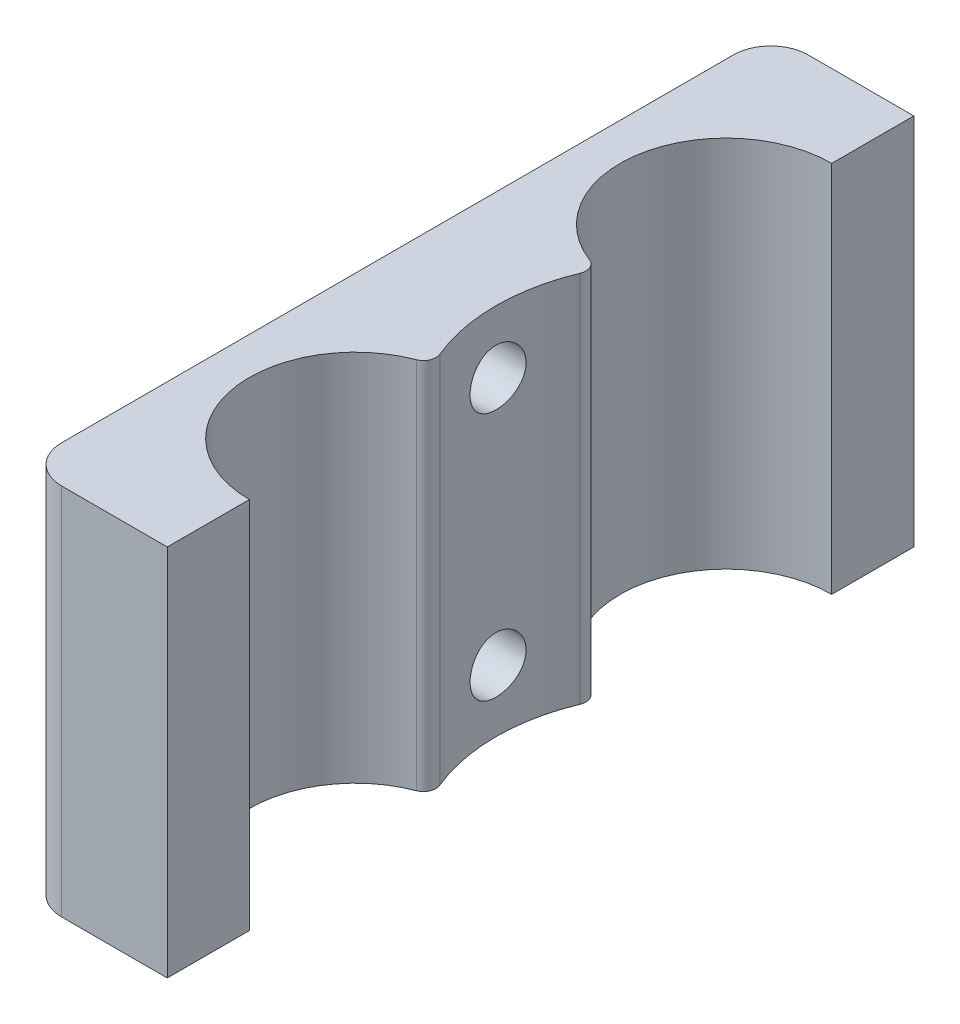
ISO-10303-21;
HEADER;
FILE_DESCRIPTION(('STEP AP214'),'2;1');
FILE_NAME('part.step','',(''),(''),'','','');
FILE_SCHEMA(('AUTOMOTIVE_DESIGN { 1 0 10303 214 1 1 1 1 }'));
ENDSEC;
DATA;
#1=APPLICATION_CONTEXT('core data for automotive mechanical design processes');
#2=APPLICATION_PROTOCOL_DEFINITION('international standard','automotive_design',2000,#1);
#3=PRODUCT_CONTEXT('',#1,'mechanical');
#4=PRODUCT('Part','Part','',(#3));
#5=PRODUCT_RELATED_PRODUCT_CATEGORY('part','',(#4));
#6=PRODUCT_DEFINITION_FORMATION('','',#4);
#7=PRODUCT_DEFINITION_CONTEXT('part definition',#1,'design');
#8=PRODUCT_DEFINITION('design','',#6,#7);
#9=PRODUCT_DEFINITION_SHAPE('','',#8);
#10=(LENGTH_UNIT() NAMED_UNIT(*) SI_UNIT(.MILLI.,.METRE.));
#11=(NAMED_UNIT(*) PLANE_ANGLE_UNIT() SI_UNIT($,.RADIAN.));
#12=(NAMED_UNIT(*) SI_UNIT($,.STERADIAN.) SOLID_ANGLE_UNIT());
#13=UNCERTAINTY_MEASURE_WITH_UNIT(LENGTH_MEASURE(1.E-05),#10,'distance_accuracy_value','');
#14=(GEOMETRIC_REPRESENTATION_CONTEXT(3) GLOBAL_UNCERTAINTY_ASSIGNED_CONTEXT((#13)) GLOBAL_UNIT_ASSIGNED_CONTEXT((#10,
#11,#12)) REPRESENTATION_CONTEXT('',''));
#15=CARTESIAN_POINT('',(0.,0.,0.));
#16=DIRECTION('',(0.,0.,1.));
#17=DIRECTION('',(1.,0.,0.));
#18=AXIS2_PLACEMENT_3D('',#15,#16,#17);
#19=CARTESIAN_POINT('',(-11.5,30.,0.));
#20=DIRECTION('',(0.,0.,1.));
#21=DIRECTION('',(1.,0.,0.));
#22=AXIS2_PLACEMENT_3D('',#19,#20,#21);
#23=PLANE('',#22);
#24=DIRECTION('',(-1.,0.,0.));
#25=VECTOR('',#24,1.);
#26=CARTESIAN_POINT('',(-11.5,30.,0.));
#27=LINE('',#26,#25);
#28=CARTESIAN_POINT('',(0.,30.,0.));
#29=VERTEX_POINT('',#28);
#30=CARTESIAN_POINT('',(-8.49999999999999,30.,0.));
#31=VERTEX_POINT('',#30);
#32=EDGE_CURVE('E166',#29,#31,#27,.T.);
#33=ORIENTED_EDGE('',*,*,#32,.T.);
#34=DIRECTION('',(0.,-1.,0.));
#35=VECTOR('',#34,1.);
#36=CARTESIAN_POINT('',(-8.49999999999999,30.,0.));
#37=LINE('',#36,#35);
#38=CARTESIAN_POINT('',(-8.49999999999999,0.,0.));
#39=VERTEX_POINT('',#38);
#40=EDGE_CURVE('E191',#31,#39,#37,.T.);
#41=ORIENTED_EDGE('',*,*,#40,.T.);
#42=DIRECTION('',(-1.,0.,0.));
#43=VECTOR('',#42,1.);
#44=CARTESIAN_POINT('',(-11.5,0.,0.));
#45=LINE('',#44,#43);
#46=CARTESIAN_POINT('',(0.,0.,0.));
#47=VERTEX_POINT('',#46);
#48=EDGE_CURVE('E148',#47,#39,#45,.T.);
#49=ORIENTED_EDGE('',*,*,#48,.F.);
#50=DIRECTION('',(0.,-1.,0.));
#51=VECTOR('',#50,1.);
#52=CARTESIAN_POINT('',(0.,30.,0.));
#53=LINE('',#52,#51);
#54=EDGE_CURVE('E167',#29,#47,#53,.T.);
#55=ORIENTED_EDGE('',*,*,#54,.F.);
#56=EDGE_LOOP('',(#33,#41,#49,#55));
#57=FACE_BOUND('',#56,.T.);
#58=ADVANCED_FACE('F32',(#57),#23,.T.);
#59=CARTESIAN_POINT('',(0.,30.,-6.6));
#60=DIRECTION('',(1.,0.,0.));
#61=DIRECTION('',(0.,0.,-1.));
#62=AXIS2_PLACEMENT_3D('',#59,#60,#61);
#63=PLANE('',#62);
#64=DIRECTION('',(0.,0.,1.));
#65=VECTOR('',#64,1.);
#66=CARTESIAN_POINT('',(0.,0.,-6.6));
#67=LINE('',#66,#65);
#68=CARTESIAN_POINT('',(0.,0.,-6.6));
#69=VERTEX_POINT('',#68);
#70=EDGE_CURVE('E163',#69,#47,#67,.T.);
#71=ORIENTED_EDGE('',*,*,#70,.F.);
#72=DIRECTION('',(0.,-1.,0.));
#73=VECTOR('',#72,1.);
#74=CARTESIAN_POINT('',(0.,30.,-6.6));
#75=LINE('',#74,#73);
#76=CARTESIAN_POINT('',(0.,30.,-6.6));
#77=VERTEX_POINT('',#76);
#78=EDGE_CURVE('E170',#77,#69,#75,.T.);
#79=ORIENTED_EDGE('',*,*,#78,.F.);
#80=DIRECTION('',(0.,0.,1.));
#81=VECTOR('',#80,1.);
#82=CARTESIAN_POINT('',(0.,30.,-6.6));
#83=LINE('',#82,#81);
#84=EDGE_CURVE('E134',#77,#29,#83,.T.);
#85=ORIENTED_EDGE('',*,*,#84,.T.);
#86=ORIENTED_EDGE('',*,*,#54,.T.);
#87=EDGE_LOOP('',(#71,#79,#85,#86));
#88=FACE_BOUND('',#87,.T.);
#89=ADVANCED_FACE('F242',(#88),#63,.T.);
#90=CARTESIAN_POINT('',(0.,30.,-15.1));
#91=DIRECTION('',(0.,-1.,0.));
#92=DIRECTION('',(0.,0.,-1.));
#93=AXIS2_PLACEMENT_3D('',#90,#91,#92);
#94=CYLINDRICAL_SURFACE('',#93,8.49999999999999);
#95=CARTESIAN_POINT('',(0.,0.,-15.1));
#96=DIRECTION('',(0.,1.,0.));
#97=DIRECTION('',(0.,0.,1.));
#98=AXIS2_PLACEMENT_3D('',#95,#96,#97);
#99=CIRCLE('',#98,8.49999999999999);
#100=CARTESIAN_POINT('',(-3.02764488857947,0.,-23.0425037883943));
#101=VERTEX_POINT('',#100);
#102=EDGE_CURVE('E161',#101,#69,#99,.T.);
#103=ORIENTED_EDGE('',*,*,#102,.F.);
#104=DIRECTION('',(0.,-1.,0.));
#105=VECTOR('',#104,1.);
#106=CARTESIAN_POINT('',(-3.02764488857947,30.,-23.0425037883943));
#107=LINE('',#106,#105);
#108=CARTESIAN_POINT('',(-3.02764488857947,30.,-23.0425037883943));
#109=VERTEX_POINT('',#108);
#110=EDGE_CURVE('E189',#101,#109,#107,.F.);
#111=ORIENTED_EDGE('',*,*,#110,.T.);
#112=CARTESIAN_POINT('',(0.,30.,-15.1));
#113=DIRECTION('',(0.,1.,0.));
#114=DIRECTION('',(0.,0.,1.));
#115=AXIS2_PLACEMENT_3D('',#112,#113,#114);
#116=CIRCLE('',#115,8.49999999999999);
#117=EDGE_CURVE('E141',#109,#77,#116,.T.);
#118=ORIENTED_EDGE('',*,*,#117,.T.);
#119=ORIENTED_EDGE('',*,*,#78,.T.);
#120=EDGE_LOOP('',(#103,#111,#118,#119));
#121=FACE_BOUND('',#120,.T.);
#122=ADVANCED_FACE('F248',(#121),#94,.F.);
#123=CARTESIAN_POINT('',(0.,30.,-44.9));
#124=DIRECTION('',(0.,-1.,0.));
#125=DIRECTION('',(0.,0.,-1.));
#126=AXIS2_PLACEMENT_3D('',#123,#124,#125);
#127=CYLINDRICAL_SURFACE('',#126,8.5);
#128=CARTESIAN_POINT('',(0.,30.,-44.9));
#129=DIRECTION('',(0.,1.,0.));
#130=DIRECTION('',(0.,0.,1.));
#131=AXIS2_PLACEMENT_3D('',#128,#129,#130);
#132=CIRCLE('',#131,8.5);
#133=CARTESIAN_POINT('',(0.,30.,-53.4));
#134=VERTEX_POINT('',#133);
#135=CARTESIAN_POINT('',(-3.02764488857949,30.,-36.9574962116057));
#136=VERTEX_POINT('',#135);
#137=EDGE_CURVE('E139',#134,#136,#132,.T.);
#138=ORIENTED_EDGE('',*,*,#137,.T.);
#139=DIRECTION('',(0.,-1.,0.));
#140=VECTOR('',#139,1.);
#141=CARTESIAN_POINT('',(-3.02764488857949,30.,-36.9574962116057));
#142=LINE('',#141,#140);
#143=CARTESIAN_POINT('',(-3.02764488857949,0.,-36.9574962116057));
#144=VERTEX_POINT('',#143);
#145=EDGE_CURVE('E169',#136,#144,#142,.T.);
#146=ORIENTED_EDGE('',*,*,#145,.T.);
#147=CARTESIAN_POINT('',(0.,0.,-44.9));
#148=DIRECTION('',(0.,1.,0.));
#149=DIRECTION('',(0.,0.,1.));
#150=AXIS2_PLACEMENT_3D('',#147,#148,#149);
#151=CIRCLE('',#150,8.5);
#152=CARTESIAN_POINT('',(0.,0.,-53.4));
#153=VERTEX_POINT('',#152);
#154=EDGE_CURVE('E158',#153,#144,#151,.T.);
#155=ORIENTED_EDGE('',*,*,#154,.F.);
#156=DIRECTION('',(0.,-1.,0.));
#157=VECTOR('',#156,1.);
#158=CARTESIAN_POINT('',(0.,30.,-53.4));
#159=LINE('',#158,#157);
#160=EDGE_CURVE('E133',#134,#153,#159,.T.);
#161=ORIENTED_EDGE('',*,*,#160,.F.);
#162=EDGE_LOOP('',(#138,#146,#155,#161));
#163=FACE_BOUND('',#162,.T.);
#164=ADVANCED_FACE('F308',(#163),#127,.F.);
#165=CARTESIAN_POINT('',(0.,30.,-60.));
#166=DIRECTION('',(1.,0.,0.));
#167=DIRECTION('',(0.,0.,-1.));
#168=AXIS2_PLACEMENT_3D('',#165,#166,#167);
#169=PLANE('',#168);
#170=DIRECTION('',(0.,0.,1.));
#171=VECTOR('',#170,1.);
#172=CARTESIAN_POINT('',(0.,0.,-60.));
#173=LINE('',#172,#171);
#174=CARTESIAN_POINT('',(0.,0.,-60.));
#175=VERTEX_POINT('',#174);
#176=EDGE_CURVE('E132',#175,#153,#173,.T.);
#177=ORIENTED_EDGE('',*,*,#176,.F.);
#178=DIRECTION('',(0.,-1.,0.));
#179=VECTOR('',#178,1.);
#180=CARTESIAN_POINT('',(0.,30.,-60.));
#181=LINE('',#180,#179);
#182=CARTESIAN_POINT('',(0.,30.,-60.));
#183=VERTEX_POINT('',#182);
#184=EDGE_CURVE('E122',#183,#175,#181,.T.);
#185=ORIENTED_EDGE('',*,*,#184,.F.);
#186=DIRECTION('',(0.,0.,1.));
#187=VECTOR('',#186,1.);
#188=CARTESIAN_POINT('',(0.,30.,-60.));
#189=LINE('',#188,#187);
#190=EDGE_CURVE('E125',#183,#134,#189,.T.);
#191=ORIENTED_EDGE('',*,*,#190,.T.);
#192=ORIENTED_EDGE('',*,*,#160,.T.);
#193=EDGE_LOOP('',(#177,#185,#191,#192));
#194=FACE_BOUND('',#193,.T.);
#195=ADVANCED_FACE('F130',(#194),#169,.T.);
#196=CARTESIAN_POINT('',(-11.5,30.,-60.));
#197=DIRECTION('',(0.,0.,-1.));
#198=DIRECTION('',(-1.,0.,0.));
#199=AXIS2_PLACEMENT_3D('',#196,#197,#198);
#200=PLANE('',#199);
#201=DIRECTION('',(1.,0.,0.));
#202=VECTOR('',#201,1.);
#203=CARTESIAN_POINT('',(-11.5,0.,-60.));
#204=LINE('',#203,#202);
#205=CARTESIAN_POINT('',(-8.49999999999999,0.,-60.));
#206=VERTEX_POINT('',#205);
#207=EDGE_CURVE('E155',#206,#175,#204,.T.);
#208=ORIENTED_EDGE('',*,*,#207,.F.);
#209=DIRECTION('',(0.,-1.,0.));
#210=VECTOR('',#209,1.);
#211=CARTESIAN_POINT('',(-8.49999999999999,30.,-60.));
#212=LINE('',#211,#210);
#213=CARTESIAN_POINT('',(-8.49999999999999,30.,-60.));
#214=VERTEX_POINT('',#213);
#215=EDGE_CURVE('E11',#206,#214,#212,.F.);
#216=ORIENTED_EDGE('',*,*,#215,.T.);
#217=DIRECTION('',(1.,0.,0.));
#218=VECTOR('',#217,1.);
#219=CARTESIAN_POINT('',(-11.5,30.,-60.));
#220=LINE('',#219,#218);
#221=EDGE_CURVE('E119',#214,#183,#220,.T.);
#222=ORIENTED_EDGE('',*,*,#221,.T.);
#223=ORIENTED_EDGE('',*,*,#184,.T.);
#224=EDGE_LOOP('',(#208,#216,#222,#223));
#225=FACE_BOUND('',#224,.T.);
#226=ADVANCED_FACE('F121',(#225),#200,.T.);
#227=CARTESIAN_POINT('',(-11.5,30.,-44.9));
#228=DIRECTION('',(-1.,0.,0.));
#229=DIRECTION('',(0.,0.,1.));
#230=AXIS2_PLACEMENT_3D('',#227,#228,#229);
#231=PLANE('',#230);
#232=CARTESIAN_POINT('',(-11.5,5.,-30.));
#233=DIRECTION('',(-1.,0.,0.));
#234=DIRECTION('',(0.,0.,1.));
#235=AXIS2_PLACEMENT_3D('',#232,#233,#234);
#236=CIRCLE('',#235,3.99999999999999);
#237=CARTESIAN_POINT('',(-11.5,5.,-26.));
#238=VERTEX_POINT('',#237);
#239=EDGE_CURVE('E329',#238,#238,#236,.T.);
#240=ORIENTED_EDGE('',*,*,#239,.F.);
#241=EDGE_LOOP('',(#240));
#242=FACE_BOUND('',#241,.T.);
#243=CARTESIAN_POINT('',(-11.5,25.,-30.));
#244=DIRECTION('',(-1.,0.,0.));
#245=DIRECTION('',(0.,0.,1.));
#246=AXIS2_PLACEMENT_3D('',#243,#244,#245);
#247=CIRCLE('',#246,3.99999999999999);
#248=CARTESIAN_POINT('',(-11.5,25.,-26.));
#249=VERTEX_POINT('',#248);
#250=EDGE_CURVE('E332',#249,#249,#247,.T.);
#251=ORIENTED_EDGE('',*,*,#250,.F.);
#252=EDGE_LOOP('',(#251));
#253=FACE_BOUND('',#252,.T.);
#254=DIRECTION('',(0.,0.,-1.));
#255=VECTOR('',#254,1.);
#256=CARTESIAN_POINT('',(-11.5,0.,-44.9));
#257=LINE('',#256,#255);
#258=CARTESIAN_POINT('',(-11.5,0.,-3.));
#259=VERTEX_POINT('',#258);
#260=CARTESIAN_POINT('',(-11.5,0.,-57.));
#261=VERTEX_POINT('',#260);
#262=EDGE_CURVE('E151',#259,#261,#257,.T.);
#263=ORIENTED_EDGE('',*,*,#262,.F.);
#264=DIRECTION('',(0.,-1.,0.));
#265=VECTOR('',#264,1.);
#266=CARTESIAN_POINT('',(-11.5,30.,-3.));
#267=LINE('',#266,#265);
#268=CARTESIAN_POINT('',(-11.5,30.,-3.));
#269=VERTEX_POINT('',#268);
#270=EDGE_CURVE('E287',#259,#269,#267,.F.);
#271=ORIENTED_EDGE('',*,*,#270,.T.);
#272=DIRECTION('',(0.,0.,-1.));
#273=VECTOR('',#272,1.);
#274=CARTESIAN_POINT('',(-11.5,30.,-15.1));
#275=LINE('',#274,#273);
#276=CARTESIAN_POINT('',(-11.5,30.,-57.));
#277=VERTEX_POINT('',#276);
#278=EDGE_CURVE('E126',#269,#277,#275,.T.);
#279=ORIENTED_EDGE('',*,*,#278,.T.);
#280=DIRECTION('',(0.,-1.,0.));
#281=VECTOR('',#280,1.);
#282=CARTESIAN_POINT('',(-11.5,30.,-57.));
#283=LINE('',#282,#281);
#284=EDGE_CURVE('E285',#277,#261,#283,.T.);
#285=ORIENTED_EDGE('',*,*,#284,.T.);
#286=EDGE_LOOP('',(#263,#271,#279,#285));
#287=FACE_BOUND('',#286,.T.);
#288=ADVANCED_FACE('F254',(#242,#253,#287),#231,.T.);
#289=CARTESIAN_POINT('',(0.,30.,-15.1));
#290=DIRECTION('',(0.,1.,0.));
#291=DIRECTION('',(0.,0.,1.));
#292=AXIS2_PLACEMENT_3D('',#289,#290,#291);
#293=PLANE('',#292);
#294=ORIENTED_EDGE('',*,*,#278,.F.);
#295=CARTESIAN_POINT('',(-8.49999999999999,30.,-3.));
#296=DIRECTION('',(0.,1.,0.));
#297=DIRECTION('',(0.,0.,1.));
#298=AXIS2_PLACEMENT_3D('',#295,#296,#297);
#299=CIRCLE('',#298,3.);
#300=EDGE_CURVE('E40',#269,#31,#299,.T.);
#301=ORIENTED_EDGE('',*,*,#300,.T.);
#302=ORIENTED_EDGE('',*,*,#32,.F.);
#303=ORIENTED_EDGE('',*,*,#84,.F.);
#304=ORIENTED_EDGE('',*,*,#117,.F.);
#305=CARTESIAN_POINT('',(-3.38383840488294,30.,-23.9769159987937));
#306=DIRECTION('',(0.,1.,0.));
#307=DIRECTION('',(0.,0.,1.));
#308=AXIS2_PLACEMENT_3D('',#305,#306,#307);
#309=CIRCLE('',#308,1.);
#310=CARTESIAN_POINT('',(-2.4605443380345,30.,-24.3610098234283));
#311=VERTEX_POINT('',#310);
#312=EDGE_CURVE('E185',#109,#311,#309,.T.);
#313=ORIENTED_EDGE('',*,*,#312,.T.);
#314=CARTESIAN_POINT('',(11.0945972422748,30.,-30.));
#315=DIRECTION('',(0.,-1.,0.));
#316=DIRECTION('',(0.,0.,1.));
#317=AXIS2_PLACEMENT_3D('',#314,#315,#316);
#318=CIRCLE('',#317,14.6812831003867);
#319=CARTESIAN_POINT('',(-2.46054433803452,30.,-35.6389901765717));
#320=VERTEX_POINT('',#319);
#321=EDGE_CURVE('E152',#311,#320,#318,.T.);
#322=ORIENTED_EDGE('',*,*,#321,.T.);
#323=CARTESIAN_POINT('',(-3.38383840488296,30.,-36.0230840012063));
#324=DIRECTION('',(0.,1.,0.));
#325=DIRECTION('',(0.,0.,1.));
#326=AXIS2_PLACEMENT_3D('',#323,#324,#325);
#327=CIRCLE('',#326,1.);
#328=EDGE_CURVE('E187',#320,#136,#327,.T.);
#329=ORIENTED_EDGE('',*,*,#328,.T.);
#330=ORIENTED_EDGE('',*,*,#137,.F.);
#331=ORIENTED_EDGE('',*,*,#190,.F.);
#332=ORIENTED_EDGE('',*,*,#221,.F.);
#333=CARTESIAN_POINT('',(-8.49999999999999,30.,-57.));
#334=DIRECTION('',(0.,1.,0.));
#335=DIRECTION('',(0.,0.,1.));
#336=AXIS2_PLACEMENT_3D('',#333,#334,#335);
#337=CIRCLE('',#336,3.);
#338=EDGE_CURVE('E52',#214,#277,#337,.T.);
#339=ORIENTED_EDGE('',*,*,#338,.T.);
#340=EDGE_LOOP('',(#294,#301,#302,#303,#304,#313,#322,#329,#330,#331,#332,#339));
#341=FACE_BOUND('',#340,.T.);
#342=ADVANCED_FACE('F137',(#341),#293,.T.);
#343=CARTESIAN_POINT('',(0.,0.,-15.1));
#344=DIRECTION('',(0.,1.,0.));
#345=DIRECTION('',(0.,0.,1.));
#346=AXIS2_PLACEMENT_3D('',#343,#344,#345);
#347=PLANE('',#346);
#348=ORIENTED_EDGE('',*,*,#48,.T.);
#349=CARTESIAN_POINT('',(-8.49999999999999,0.,-3.));
#350=DIRECTION('',(0.,1.,0.));
#351=DIRECTION('',(0.,0.,1.));
#352=AXIS2_PLACEMENT_3D('',#349,#350,#351);
#353=CIRCLE('',#352,3.);
#354=EDGE_CURVE('E291',#39,#259,#353,.F.);
#355=ORIENTED_EDGE('',*,*,#354,.T.);
#356=ORIENTED_EDGE('',*,*,#262,.T.);
#357=CARTESIAN_POINT('',(-8.49999999999999,0.,-57.));
#358=DIRECTION('',(0.,1.,0.));
#359=DIRECTION('',(0.,0.,1.));
#360=AXIS2_PLACEMENT_3D('',#357,#358,#359);
#361=CIRCLE('',#360,3.);
#362=EDGE_CURVE('E290',#261,#206,#361,.F.);
#363=ORIENTED_EDGE('',*,*,#362,.T.);
#364=ORIENTED_EDGE('',*,*,#207,.T.);
#365=ORIENTED_EDGE('',*,*,#176,.T.);
#366=ORIENTED_EDGE('',*,*,#154,.T.);
#367=CARTESIAN_POINT('',(-3.38383840488296,0.,-36.0230840012063));
#368=DIRECTION('',(0.,1.,0.));
#369=DIRECTION('',(0.,0.,1.));
#370=AXIS2_PLACEMENT_3D('',#367,#368,#369);
#371=CIRCLE('',#370,1.);
#372=CARTESIAN_POINT('',(-2.46054433803452,0.,-35.6389901765717));
#373=VERTEX_POINT('',#372);
#374=EDGE_CURVE('E178',#144,#373,#371,.F.);
#375=ORIENTED_EDGE('',*,*,#374,.T.);
#376=CARTESIAN_POINT('',(11.0945972422748,0.,-30.));
#377=DIRECTION('',(0.,-1.,0.));
#378=DIRECTION('',(0.,0.,1.));
#379=AXIS2_PLACEMENT_3D('',#376,#377,#378);
#380=CIRCLE('',#379,14.6812831003867);
#381=CARTESIAN_POINT('',(-2.4605443380345,0.,-24.3610098234283));
#382=VERTEX_POINT('',#381);
#383=EDGE_CURVE('E199',#382,#373,#380,.T.);
#384=ORIENTED_EDGE('',*,*,#383,.F.);
#385=CARTESIAN_POINT('',(-3.38383840488294,0.,-23.9769159987937));
#386=DIRECTION('',(0.,1.,0.));
#387=DIRECTION('',(0.,0.,1.));
#388=AXIS2_PLACEMENT_3D('',#385,#386,#387);
#389=CIRCLE('',#388,1.);
#390=EDGE_CURVE('E176',#382,#101,#389,.F.);
#391=ORIENTED_EDGE('',*,*,#390,.T.);
#392=ORIENTED_EDGE('',*,*,#102,.T.);
#393=ORIENTED_EDGE('',*,*,#70,.T.);
#394=EDGE_LOOP('',(#348,#355,#356,#363,#364,#365,#366,#375,#384,#391,#392,#393));
#395=FACE_BOUND('',#394,.T.);
#396=ADVANCED_FACE('F302',(#395),#347,.F.);
#397=CARTESIAN_POINT('',(11.0945972422748,30.,-30.));
#398=DIRECTION('',(0.,-1.,0.));
#399=DIRECTION('',(0.,0.,-1.));
#400=AXIS2_PLACEMENT_3D('',#397,#398,#399);
#401=CYLINDRICAL_SURFACE('',#400,14.6812831003867);
#402=CARTESIAN_POINT('',(-3.41324799655037,5.,-27.75));
#403=CARTESIAN_POINT('',(-3.4132501306852,5.12558466162485,-27.7500051624007));
#404=CARTESIAN_POINT('',(-3.41489629912545,5.25124141553229,-27.7605499029394));
#405=CARTESIAN_POINT('',(-3.4212983619856,5.49903935876949,-27.8024377233869));
#406=CARTESIAN_POINT('',(-3.42605725853958,5.6211770351998,-27.8338008824773));
#407=CARTESIAN_POINT('',(-3.43813340197542,5.85831425988325,-27.9163631766303));
#408=CARTESIAN_POINT('',(-3.44544865235394,5.97331929640873,-27.9675468353159));
#409=CARTESIAN_POINT('',(-3.4618108914641,6.19309320417532,-28.0882603605009));
#410=CARTESIAN_POINT('',(-3.47085764993497,6.29786343367462,-28.1577877880596));
#411=CARTESIAN_POINT('',(-3.48974803710841,6.49508427957007,-28.3138352577365));
#412=CARTESIAN_POINT('',(-3.4995971140206,6.58743701365851,-28.4004783647873));
#413=CARTESIAN_POINT('',(-3.51893381189072,6.7563527150503,-28.5880319290544));
#414=CARTESIAN_POINT('',(-3.52842141266669,6.8329148017794,-28.6889431814132));
#415=CARTESIAN_POINT('',(-3.54602329214903,6.96843824483598,-28.9027969906392));
#416=CARTESIAN_POINT('',(-3.554130434728,7.02730927908646,-29.0157974238528));
#417=CARTESIAN_POINT('',(-3.56799754462814,7.12519968337152,-29.2502275714364));
#418=CARTESIAN_POINT('',(-3.57375764129842,7.16422014742944,-29.3716568208503));
#419=CARTESIAN_POINT('',(-3.58224321195783,7.22100452850012,-29.6184889653117));
#420=CARTESIAN_POINT('',(-3.58499209025343,7.23893246642423,-29.7438533092911));
#421=CARTESIAN_POINT('',(-3.58722575106225,7.25353232188595,-29.9958389382318));
#422=CARTESIAN_POINT('',(-3.58671072260965,7.25020547042735,-30.1224601499757));
#423=CARTESIAN_POINT('',(-3.58249326739323,7.22251933738645,-30.3722457028808));
#424=CARTESIAN_POINT('',(-3.57881758511678,7.19833652748337,-30.4954301198509));
#425=CARTESIAN_POINT('',(-3.56872161993371,7.12990210704263,-30.7359716515746));
#426=CARTESIAN_POINT('',(-3.562301263885,7.0856499616806,-30.8533286109408));
#427=CARTESIAN_POINT('',(-3.54739145540601,6.97815335888429,-31.0794162816912));
#428=CARTESIAN_POINT('',(-3.53889396638003,6.91483490626128,-31.1881112594455));
#429=CARTESIAN_POINT('',(-3.52077638131489,6.771057125912,-31.3933999118408));
#430=CARTESIAN_POINT('',(-3.51115620820935,6.69059662116025,-31.4899927547888));
#431=CARTESIAN_POINT('',(-3.4917490032319,6.51383643250662,-31.6693759215235));
#432=CARTESIAN_POINT('',(-3.48196127222544,6.41738264179236,-31.7520143891369));
#433=CARTESIAN_POINT('',(-3.46341826299472,6.21189661428454,-31.8999563929977));
#434=CARTESIAN_POINT('',(-3.45466299166939,6.10286429345024,-31.9652598134151));
#435=CARTESIAN_POINT('',(-3.43917628396453,5.87515460956891,-32.0767002591163));
#436=CARTESIAN_POINT('',(-3.43244654995941,5.75646923937222,-32.1228211747153));
#437=CARTESIAN_POINT('',(-3.42180261751123,5.51291062648477,-32.194431974749));
#438=CARTESIAN_POINT('',(-3.41788821147057,5.38803784076972,-32.2199233803868));
#439=CARTESIAN_POINT('',(-3.41335766280658,5.13700159190198,-32.2493422448933));
#440=CARTESIAN_POINT('',(-3.41270856165167,5.01086395664182,-32.2534851959656));
#441=CARTESIAN_POINT('',(-3.41469455999031,4.75969605872414,-32.2406618080283));
#442=CARTESIAN_POINT('',(-3.41732955294147,4.63466576027497,-32.2236961538228));
#443=CARTESIAN_POINT('',(-3.42555653290844,4.38993245723924,-32.1693200967734));
#444=CARTESIAN_POINT('',(-3.43113292409753,4.27020493187824,-32.132017489434));
#445=CARTESIAN_POINT('',(-3.44460147732355,4.03870156585209,-32.0381387146899));
#446=CARTESIAN_POINT('',(-3.45249375832196,3.92692613403262,-31.9815615571758));
#447=CARTESIAN_POINT('',(-3.46978227753777,3.71353515748957,-31.8502236722849));
#448=CARTESIAN_POINT('',(-3.47918983367644,3.61200624021397,-31.7753237128792));
#449=CARTESIAN_POINT('',(-3.49841500702902,3.42288179250503,-31.6096594512877));
#450=CARTESIAN_POINT('',(-3.50823264845587,3.33528708627096,-31.5188942113471));
#451=CARTESIAN_POINT('',(-3.52727503216545,3.17574121465018,-31.3231257839154));
#452=CARTESIAN_POINT('',(-3.53649386193656,3.10393302966203,-31.2180054108541));
#453=CARTESIAN_POINT('',(-3.55320748299349,2.97899573116129,-30.9970686076158));
#454=CARTESIAN_POINT('',(-3.56070232311431,2.92586608852412,-30.8812524805449));
#455=CARTESIAN_POINT('',(-3.57309763260976,2.84002137284282,-30.6426540962944));
#456=CARTESIAN_POINT('',(-3.5780079458112,2.80722875469464,-30.5199002719343));
#457=CARTESIAN_POINT('',(-3.58472231965629,2.76273821678333,-30.2705473016224));
#458=CARTESIAN_POINT('',(-3.58652659485852,2.75103883994072,-30.1439484218938));
#459=CARTESIAN_POINT('',(-3.58682328435822,2.74910364511238,-29.8918844964645));
#460=CARTESIAN_POINT('',(-3.58534941965209,2.75864928822715,-29.7664211137025));
#461=CARTESIAN_POINT('',(-3.57932358800609,2.79846394136521,-29.5189061322759));
#462=CARTESIAN_POINT('',(-3.57477163220491,2.82873287639708,-29.3968545212666));
#463=CARTESIAN_POINT('',(-3.56309879386403,2.90905614859658,-29.1596921154408));
#464=CARTESIAN_POINT('',(-3.55597996114583,2.95909470145607,-29.0445758676433));
#465=CARTESIAN_POINT('',(-3.53995437350882,3.07751330989251,-28.8243389758151));
#466=CARTESIAN_POINT('',(-3.53104755544649,3.14589401325959,-28.7192186849894));
#467=CARTESIAN_POINT('',(-3.51232674349432,3.29984318994033,-28.5208506167508));
#468=CARTESIAN_POINT('',(-3.50250474950946,3.38557278323671,-28.427728624175));
#469=CARTESIAN_POINT('',(-3.48311903638344,3.57144722856503,-28.2571133416457));
#470=CARTESIAN_POINT('',(-3.47355537835869,3.67159545685372,-28.1796237223902));
#471=CARTESIAN_POINT('',(-3.45570873347389,3.88415877142688,-28.0420614138116));
#472=CARTESIAN_POINT('',(-3.44743361392839,3.99664257449707,-27.9820938982119));
#473=CARTESIAN_POINT('',(-3.43319334736519,4.2301611306875,-27.8819932700368));
#474=CARTESIAN_POINT('',(-3.42722582120609,4.35118692386541,-27.8418397172974));
#475=CARTESIAN_POINT('',(-3.4196448179984,4.56061926889862,-27.7915464646455));
#476=CARTESIAN_POINT('',(-3.41725884342012,4.64773683263514,-27.7759905932782));
#477=CARTESIAN_POINT('',(-3.41405969242907,4.82322436739604,-27.7552156155367));
#478=CARTESIAN_POINT('',(-3.41324649422011,4.91159432104719,-27.7499963659134));
#479=CARTESIAN_POINT('',(-3.41324799655037,5.,-27.75));
#480=B_SPLINE_CURVE_WITH_KNOTS('',3,(#402,#403,#404,#405,#406,#407,#408,#409,#410,#411,#412,
#413,#414,#415,#416,#417,#418,#419,#420,#421,#422,#423,#424,#425,#426,#427,#428,#429,#430,#431,
#432,#433,#434,#435,#436,#437,#438,#439,#440,#441,#442,#443,#444,#445,#446,#447,#448,#449,#450,
#451,#452,#453,#454,#455,#456,#457,#458,#459,#460,#461,#462,#463,#464,#465,#466,#467,#468,#469,
#470,#471,#472,#473,#474,#475,#476,#477,#478,#479),.UNSPECIFIED.,.T.,.F.,(4,2,2,2,2,2,2,2,2,2,2,
2,2,2,2,2,2,2,2,2,2,2,2,2,2,2,2,2,2,2,2,2,2,2,2,2,2,2,4),(0.,0.376430824461,0.753225241707714,
1.12972603910196,1.50617680311517,1.88543988545906,2.26472411190517,2.64591310943615,
3.02708109624328,3.40526500943559,3.78342701972372,4.15842027824376,4.53342353048413,
4.90990132736089,5.28640498268515,5.6667733360384,6.04714423088831,6.42783392364392,
6.80849554209473,7.18530711207623,7.56210645787577,7.93692773576628,8.31176827065883,
8.68955081462477,9.06735569587363,9.44845301496842,9.82953953749204,10.2091638956893,
10.5887620291805,10.9644734565001,11.3401835242389,11.7155942246372,12.0910181851696,
12.4701034686094,12.8492776631831,13.2306831194737,13.6116942894872,13.8766875090665,
14.1416770562347),.UNSPECIFIED.);
#481=CARTESIAN_POINT('',(-3.41324799655037,5.,-27.75));
#482=VERTEX_POINT('',#481);
#483=EDGE_CURVE('E201',#482,#482,#480,.T.);
#484=ORIENTED_EDGE('',*,*,#483,.T.);
#485=EDGE_LOOP('',(#484));
#486=FACE_BOUND('',#485,.T.);
#487=CARTESIAN_POINT('',(-3.41324799655037,25.,-27.75));
#488=CARTESIAN_POINT('',(-3.4132501306852,25.1255846616249,-27.7500051624007));
#489=CARTESIAN_POINT('',(-3.41489629912545,25.2512414155323,-27.7605499029394));
#490=CARTESIAN_POINT('',(-3.4212983619856,25.4990393587695,-27.8024377233869));
#491=CARTESIAN_POINT('',(-3.42605725853958,25.6211770351998,-27.8338008824773));
#492=CARTESIAN_POINT('',(-3.43813340197542,25.8583142598833,-27.9163631766303));
#493=CARTESIAN_POINT('',(-3.44544865235394,25.9733192964088,-27.9675468353159));
#494=CARTESIAN_POINT('',(-3.4618108914641,26.1930932041753,-28.0882603605009));
#495=CARTESIAN_POINT('',(-3.47085764993497,26.2978634336746,-28.1577877880596));
#496=CARTESIAN_POINT('',(-3.48974803710841,26.4950842795701,-28.3138352577365));
#497=CARTESIAN_POINT('',(-3.4995971140206,26.5874370136585,-28.4004783647873));
#498=CARTESIAN_POINT('',(-3.51893381189072,26.7563527150503,-28.5880319290544));
#499=CARTESIAN_POINT('',(-3.52842141266669,26.8329148017794,-28.6889431814132));
#500=CARTESIAN_POINT('',(-3.54602329214903,26.968438244836,-28.9027969906392));
#501=CARTESIAN_POINT('',(-3.554130434728,27.0273092790865,-29.0157974238528));
#502=CARTESIAN_POINT('',(-3.56799754462814,27.1251996833715,-29.2502275714364));
#503=CARTESIAN_POINT('',(-3.57375764129842,27.1642201474295,-29.3716568208503));
#504=CARTESIAN_POINT('',(-3.58224321195783,27.2210045285001,-29.6184889653117));
#505=CARTESIAN_POINT('',(-3.58499209025343,27.2389324664242,-29.743853309291));
#506=CARTESIAN_POINT('',(-3.58722575106225,27.253532321886,-29.9958389382318));
#507=CARTESIAN_POINT('',(-3.58671072260965,27.2502054704274,-30.1224601499757));
#508=CARTESIAN_POINT('',(-3.58249326739323,27.2225193373865,-30.3722457028808));
#509=CARTESIAN_POINT('',(-3.57881758511678,27.1983365274834,-30.4954301198509));
#510=CARTESIAN_POINT('',(-3.56872161993371,27.1299021070426,-30.7359716515746));
#511=CARTESIAN_POINT('',(-3.562301263885,27.0856499616806,-30.8533286109408));
#512=CARTESIAN_POINT('',(-3.54739145540601,26.9781533588843,-31.0794162816912));
#513=CARTESIAN_POINT('',(-3.53889396638003,26.9148349062613,-31.1881112594455));
#514=CARTESIAN_POINT('',(-3.52077638131489,26.771057125912,-31.3933999118408));
#515=CARTESIAN_POINT('',(-3.51115620820935,26.6905966211603,-31.4899927547888));
#516=CARTESIAN_POINT('',(-3.49174900323189,26.5138364325066,-31.6693759215235));
#517=CARTESIAN_POINT('',(-3.48196127222544,26.4173826417924,-31.7520143891369));
#518=CARTESIAN_POINT('',(-3.46341826299472,26.2118966142846,-31.8999563929977));
#519=CARTESIAN_POINT('',(-3.45466299166939,26.1028642934503,-31.9652598134151));
#520=CARTESIAN_POINT('',(-3.43917628396453,25.8751546095689,-32.0767002591163));
#521=CARTESIAN_POINT('',(-3.43244654995941,25.7564692393722,-32.1228211747153));
#522=CARTESIAN_POINT('',(-3.42180261751123,25.5129106264848,-32.194431974749));
#523=CARTESIAN_POINT('',(-3.41788821147056,25.3880378407697,-32.2199233803868));
#524=CARTESIAN_POINT('',(-3.41335766280658,25.137001591902,-32.2493422448933));
#525=CARTESIAN_POINT('',(-3.41270856165167,25.0108639566418,-32.2534851959656));
#526=CARTESIAN_POINT('',(-3.41469455999031,24.7596960587242,-32.2406618080283));
#527=CARTESIAN_POINT('',(-3.41732955294146,24.634665760275,-32.2236961538228));
#528=CARTESIAN_POINT('',(-3.42555653290844,24.3899324572393,-32.1693200967734));
#529=CARTESIAN_POINT('',(-3.43113292409753,24.2702049318783,-32.132017489434));
#530=CARTESIAN_POINT('',(-3.44460147732356,24.0387015658521,-32.0381387146899));
#531=CARTESIAN_POINT('',(-3.45249375832196,23.9269261340326,-31.9815615571758));
#532=CARTESIAN_POINT('',(-3.46978227753777,23.7135351574896,-31.8502236722849));
#533=CARTESIAN_POINT('',(-3.47918983367644,23.612006240214,-31.7753237128792));
#534=CARTESIAN_POINT('',(-3.49841500702902,23.4228817925051,-31.6096594512877));
#535=CARTESIAN_POINT('',(-3.50823264845587,23.335287086271,-31.5188942113471));
#536=CARTESIAN_POINT('',(-3.52727503216545,23.1757412146502,-31.3231257839154));
#537=CARTESIAN_POINT('',(-3.53649386193656,23.1039330296621,-31.2180054108541));
#538=CARTESIAN_POINT('',(-3.55320748299349,22.9789957311613,-30.9970686076158));
#539=CARTESIAN_POINT('',(-3.56070232311431,22.9258660885241,-30.8812524805449));
#540=CARTESIAN_POINT('',(-3.57309763260976,22.8400213728428,-30.6426540962945));
#541=CARTESIAN_POINT('',(-3.5780079458112,22.8072287546947,-30.5199002719343));
#542=CARTESIAN_POINT('',(-3.58472231965629,22.7627382167833,-30.2705473016224));
#543=CARTESIAN_POINT('',(-3.58652659485852,22.7510388399407,-30.1439484218938));
#544=CARTESIAN_POINT('',(-3.58682328435822,22.7491036451124,-29.8918844964645));
#545=CARTESIAN_POINT('',(-3.58534941965209,22.7586492882272,-29.7664211137025));
#546=CARTESIAN_POINT('',(-3.57932358800609,22.7984639413652,-29.5189061322759));
#547=CARTESIAN_POINT('',(-3.57477163220491,22.8287328763971,-29.3968545212666));
#548=CARTESIAN_POINT('',(-3.56309879386403,22.9090561485966,-29.1596921154408));
#549=CARTESIAN_POINT('',(-3.55597996114583,22.9590947014561,-29.0445758676433));
#550=CARTESIAN_POINT('',(-3.53995437350882,23.0775133098925,-28.8243389758151));
#551=CARTESIAN_POINT('',(-3.53104755544649,23.1458940132596,-28.7192186849894));
#552=CARTESIAN_POINT('',(-3.51232674349432,23.2998431899403,-28.5208506167508));
#553=CARTESIAN_POINT('',(-3.50250474950946,23.3855727832367,-28.427728624175));
#554=CARTESIAN_POINT('',(-3.48311903638344,23.571447228565,-28.2571133416457));
#555=CARTESIAN_POINT('',(-3.47355537835869,23.6715954568537,-28.1796237223902));
#556=CARTESIAN_POINT('',(-3.45570873347389,23.8841587714269,-28.0420614138116));
#557=CARTESIAN_POINT('',(-3.44743361392839,23.9966425744971,-27.9820938982119));
#558=CARTESIAN_POINT('',(-3.43319334736519,24.2301611306875,-27.8819932700368));
#559=CARTESIAN_POINT('',(-3.42722582120609,24.3511869238654,-27.8418397172974));
#560=CARTESIAN_POINT('',(-3.4196448179984,24.5606192688986,-27.7915464646455));
#561=CARTESIAN_POINT('',(-3.41725884342012,24.6477368326352,-27.7759905932782));
#562=CARTESIAN_POINT('',(-3.41405969242907,24.8232243673961,-27.7552156155367));
#563=CARTESIAN_POINT('',(-3.41324649422011,24.9115943210472,-27.7499963659134));
#564=CARTESIAN_POINT('',(-3.41324799655037,25.,-27.75));
#565=B_SPLINE_CURVE_WITH_KNOTS('',3,(#487,#488,#489,#490,#491,#492,#493,#494,#495,#496,#497,
#498,#499,#500,#501,#502,#503,#504,#505,#506,#507,#508,#509,#510,#511,#512,#513,#514,#515,#516,
#517,#518,#519,#520,#521,#522,#523,#524,#525,#526,#527,#528,#529,#530,#531,#532,#533,#534,#535,
#536,#537,#538,#539,#540,#541,#542,#543,#544,#545,#546,#547,#548,#549,#550,#551,#552,#553,#554,
#555,#556,#557,#558,#559,#560,#561,#562,#563,#564),.UNSPECIFIED.,.T.,.F.,(4,2,2,2,2,2,2,2,2,2,2,
2,2,2,2,2,2,2,2,2,2,2,2,2,2,2,2,2,2,2,2,2,2,2,2,2,2,2,4),(0.,0.376430824460999,
0.753225241707711,1.12972603910196,1.50617680311516,1.88543988545906,2.26472411190516,
2.64591310943613,3.02708109624327,3.40526500943559,3.78342701972371,4.15842027824376,
4.53342353048413,4.9099013273609,5.28640498268515,5.6667733360384,6.04714423088831,
6.42783392364392,6.80849554209472,7.18530711207622,7.56210645787577,7.93692773576627,
8.31176827065883,8.68955081462478,9.06735569587363,9.44845301496842,9.82953953749204,
10.2091638956893,10.5887620291805,10.9644734565001,11.3401835242389,11.7155942246372,
12.0910181851696,12.4701034686094,12.8492776631831,13.2306831194737,13.6116942894872,
13.8766875090665,14.1416770562347),.UNSPECIFIED.);
#566=CARTESIAN_POINT('',(-3.41324799655037,25.,-27.75));
#567=VERTEX_POINT('',#566);
#568=EDGE_CURVE('E192',#567,#567,#565,.T.);
#569=ORIENTED_EDGE('',*,*,#568,.T.);
#570=EDGE_LOOP('',(#569));
#571=FACE_BOUND('',#570,.T.);
#572=ORIENTED_EDGE('',*,*,#383,.T.);
#573=DIRECTION('',(0.,-1.,0.));
#574=VECTOR('',#573,1.);
#575=CARTESIAN_POINT('',(-2.46054433803452,30.,-35.6389901765717));
#576=LINE('',#575,#574);
#577=EDGE_CURVE('E183',#373,#320,#576,.F.);
#578=ORIENTED_EDGE('',*,*,#577,.T.);
#579=ORIENTED_EDGE('',*,*,#321,.F.);
#580=DIRECTION('',(0.,-1.,0.));
#581=VECTOR('',#580,1.);
#582=CARTESIAN_POINT('',(-2.4605443380345,30.,-24.3610098234283));
#583=LINE('',#582,#581);
#584=EDGE_CURVE('E180',#311,#382,#583,.T.);
#585=ORIENTED_EDGE('',*,*,#584,.T.);
#586=EDGE_LOOP('',(#572,#578,#579,#585));
#587=FACE_BOUND('',#586,.T.);
#588=ADVANCED_FACE('F206',(#486,#571,#587),#401,.F.);
#589=CARTESIAN_POINT('',(-3.38383840488296,30.,-36.0230840012063));
#590=DIRECTION('',(0.,-1.,0.));
#591=DIRECTION('',(0.,0.,-1.));
#592=AXIS2_PLACEMENT_3D('',#589,#590,#591);
#593=CYLINDRICAL_SURFACE('',#592,1.);
#594=ORIENTED_EDGE('',*,*,#328,.F.);
#595=ORIENTED_EDGE('',*,*,#577,.F.);
#596=ORIENTED_EDGE('',*,*,#374,.F.);
#597=ORIENTED_EDGE('',*,*,#145,.F.);
#598=EDGE_LOOP('',(#594,#595,#596,#597));
#599=FACE_BOUND('',#598,.T.);
#600=ADVANCED_FACE('F256',(#599),#593,.T.);
#601=CARTESIAN_POINT('',(-3.38383840488294,30.,-23.9769159987937));
#602=DIRECTION('',(0.,-1.,0.));
#603=DIRECTION('',(0.,0.,-1.));
#604=AXIS2_PLACEMENT_3D('',#601,#602,#603);
#605=CYLINDRICAL_SURFACE('',#604,1.);
#606=ORIENTED_EDGE('',*,*,#312,.F.);
#607=ORIENTED_EDGE('',*,*,#110,.F.);
#608=ORIENTED_EDGE('',*,*,#390,.F.);
#609=ORIENTED_EDGE('',*,*,#584,.F.);
#610=EDGE_LOOP('',(#606,#607,#608,#609));
#611=FACE_BOUND('',#610,.T.);
#612=ADVANCED_FACE('F214',(#611),#605,.T.);
#613=CARTESIAN_POINT('',(-11.5,25.,-30.));
#614=DIRECTION('',(-1.,0.,0.));
#615=DIRECTION('',(0.,0.,1.));
#616=AXIS2_PLACEMENT_3D('',#613,#614,#615);
#617=CYLINDRICAL_SURFACE('',#616,2.24999999999999);
#618=CARTESIAN_POINT('',(-7.49999999999999,25.,-30.));
#619=DIRECTION('',(-1.,0.,0.));
#620=DIRECTION('',(0.,0.,1.));
#621=AXIS2_PLACEMENT_3D('',#618,#619,#620);
#622=CIRCLE('',#621,2.24999999999997);
#623=CARTESIAN_POINT('',(-7.49999999999999,25.,-27.75));
#624=VERTEX_POINT('',#623);
#625=EDGE_CURVE('E200',#624,#624,#622,.T.);
#626=ORIENTED_EDGE('',*,*,#625,.T.);
#627=EDGE_LOOP('',(#626));
#628=FACE_BOUND('',#627,.T.);
#629=ORIENTED_EDGE('',*,*,#568,.F.);
#630=EDGE_LOOP('',(#629));
#631=FACE_BOUND('',#630,.T.);
#632=ADVANCED_FACE('F209',(#628,#631),#617,.F.);
#633=CARTESIAN_POINT('',(-7.49999999999999,27.25,-30.));
#634=DIRECTION('',(1.,0.,0.));
#635=DIRECTION('',(0.,0.,-1.));
#636=AXIS2_PLACEMENT_3D('',#633,#634,#635);
#637=PLANE('',#636);
#638=ORIENTED_EDGE('',*,*,#625,.F.);
#639=EDGE_LOOP('',(#638));
#640=FACE_BOUND('',#639,.T.);
#641=CARTESIAN_POINT('',(-7.49999999999999,25.,-30.));
#642=DIRECTION('',(-1.,0.,0.));
#643=DIRECTION('',(0.,0.,1.));
#644=AXIS2_PLACEMENT_3D('',#641,#642,#643);
#645=CIRCLE('',#644,4.);
#646=CARTESIAN_POINT('',(-7.49999999999999,25.,-26.));
#647=VERTEX_POINT('',#646);
#648=EDGE_CURVE('E334',#647,#647,#645,.T.);
#649=ORIENTED_EDGE('',*,*,#648,.T.);
#650=EDGE_LOOP('',(#649));
#651=FACE_BOUND('',#650,.T.);
#652=ADVANCED_FACE('F213',(#640,#651),#637,.F.);
#653=CARTESIAN_POINT('',(-11.5,25.,-30.));
#654=DIRECTION('',(-1.,0.,0.));
#655=DIRECTION('',(0.,0.,1.));
#656=AXIS2_PLACEMENT_3D('',#653,#654,#655);
#657=CYLINDRICAL_SURFACE('',#656,3.99999999999999);
#658=ORIENTED_EDGE('',*,*,#648,.F.);
#659=EDGE_LOOP('',(#658));
#660=FACE_BOUND('',#659,.T.);
#661=ORIENTED_EDGE('',*,*,#250,.T.);
#662=EDGE_LOOP('',(#661));
#663=FACE_BOUND('',#662,.T.);
#664=ADVANCED_FACE('F218',(#660,#663),#657,.F.);
#665=CARTESIAN_POINT('',(-11.5,5.,-30.));
#666=DIRECTION('',(-1.,0.,0.));
#667=DIRECTION('',(0.,0.,1.));
#668=AXIS2_PLACEMENT_3D('',#665,#666,#667);
#669=CYLINDRICAL_SURFACE('',#668,2.24999999999999);
#670=CARTESIAN_POINT('',(-7.49999999999999,5.,-30.));
#671=DIRECTION('',(-1.,0.,0.));
#672=DIRECTION('',(0.,0.,1.));
#673=AXIS2_PLACEMENT_3D('',#670,#671,#672);
#674=CIRCLE('',#673,2.24999999999998);
#675=CARTESIAN_POINT('',(-7.49999999999999,5.,-27.75));
#676=VERTEX_POINT('',#675);
#677=EDGE_CURVE('E338',#676,#676,#674,.T.);
#678=ORIENTED_EDGE('',*,*,#677,.T.);
#679=EDGE_LOOP('',(#678));
#680=FACE_BOUND('',#679,.T.);
#681=ORIENTED_EDGE('',*,*,#483,.F.);
#682=EDGE_LOOP('',(#681));
#683=FACE_BOUND('',#682,.T.);
#684=ADVANCED_FACE('F221',(#680,#683),#669,.F.);
#685=CARTESIAN_POINT('',(-7.49999999999999,7.24999999999998,-30.));
#686=DIRECTION('',(1.,0.,0.));
#687=DIRECTION('',(0.,0.,-1.));
#688=AXIS2_PLACEMENT_3D('',#685,#686,#687);
#689=PLANE('',#688);
#690=ORIENTED_EDGE('',*,*,#677,.F.);
#691=EDGE_LOOP('',(#690));
#692=FACE_BOUND('',#691,.T.);
#693=CARTESIAN_POINT('',(-7.49999999999999,5.,-30.));
#694=DIRECTION('',(-1.,0.,0.));
#695=DIRECTION('',(0.,0.,1.));
#696=AXIS2_PLACEMENT_3D('',#693,#694,#695);
#697=CIRCLE('',#696,4.);
#698=CARTESIAN_POINT('',(-7.49999999999999,5.,-26.));
#699=VERTEX_POINT('',#698);
#700=EDGE_CURVE('E342',#699,#699,#697,.T.);
#701=ORIENTED_EDGE('',*,*,#700,.T.);
#702=EDGE_LOOP('',(#701));
#703=FACE_BOUND('',#702,.T.);
#704=ADVANCED_FACE('F226',(#692,#703),#689,.F.);
#705=CARTESIAN_POINT('',(-11.5,5.,-30.));
#706=DIRECTION('',(-1.,0.,0.));
#707=DIRECTION('',(0.,0.,1.));
#708=AXIS2_PLACEMENT_3D('',#705,#706,#707);
#709=CYLINDRICAL_SURFACE('',#708,3.99999999999999);
#710=ORIENTED_EDGE('',*,*,#700,.F.);
#711=EDGE_LOOP('',(#710));
#712=FACE_BOUND('',#711,.T.);
#713=ORIENTED_EDGE('',*,*,#239,.T.);
#714=EDGE_LOOP('',(#713));
#715=FACE_BOUND('',#714,.T.);
#716=ADVANCED_FACE('F230',(#712,#715),#709,.F.);
#717=CARTESIAN_POINT('',(-8.49999999999999,30.,-3.));
#718=DIRECTION('',(0.,-1.,0.));
#719=DIRECTION('',(0.,0.,-1.));
#720=AXIS2_PLACEMENT_3D('',#717,#718,#719);
#721=CYLINDRICAL_SURFACE('',#720,3.);
#722=ORIENTED_EDGE('',*,*,#300,.F.);
#723=ORIENTED_EDGE('',*,*,#270,.F.);
#724=ORIENTED_EDGE('',*,*,#354,.F.);
#725=ORIENTED_EDGE('',*,*,#40,.F.);
#726=EDGE_LOOP('',(#722,#723,#724,#725));
#727=FACE_BOUND('',#726,.T.);
#728=ADVANCED_FACE('F233',(#727),#721,.T.);
#729=CARTESIAN_POINT('',(-8.49999999999999,30.,-57.));
#730=DIRECTION('',(0.,-1.,0.));
#731=DIRECTION('',(0.,0.,-1.));
#732=AXIS2_PLACEMENT_3D('',#729,#730,#731);
#733=CYLINDRICAL_SURFACE('',#732,3.);
#734=ORIENTED_EDGE('',*,*,#338,.F.);
#735=ORIENTED_EDGE('',*,*,#215,.F.);
#736=ORIENTED_EDGE('',*,*,#362,.F.);
#737=ORIENTED_EDGE('',*,*,#284,.F.);
#738=EDGE_LOOP('',(#734,#735,#736,#737));
#739=FACE_BOUND('',#738,.T.);
#740=ADVANCED_FACE('F34',(#739),#733,.T.);
#741=CLOSED_SHELL('',(#58,#89,#122,#164,#195,#226,#288,#342,#396,#588,#600,#612,#632,#652,#664,
#684,#704,#716,#728,#740));
#742=MANIFOLD_SOLID_BREP('B2',#741);
#743=ADVANCED_BREP_SHAPE_REPRESENTATION('',(#18,#742),#14);
#744=SHAPE_DEFINITION_REPRESENTATION(#9,#743);
ENDSEC;
END-ISO-10303-21;
